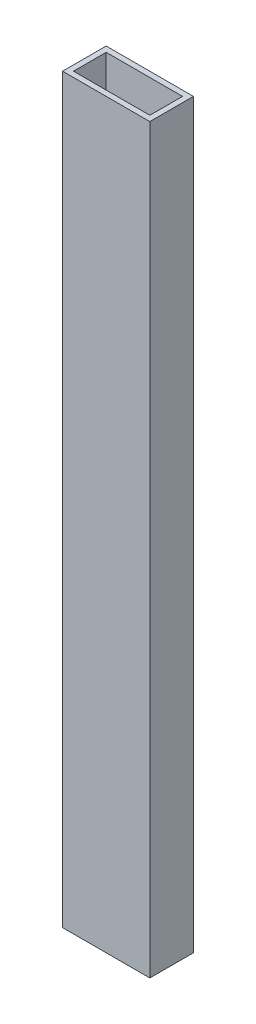
ISO-10303-21;
HEADER;
FILE_DESCRIPTION(('STEP AP214'),'2;1');
FILE_NAME('part.step','',(''),(''),'','','');
FILE_SCHEMA(('AUTOMOTIVE_DESIGN { 1 0 10303 214 1 1 1 1 }'));
ENDSEC;
DATA;
#1=APPLICATION_CONTEXT('core data for automotive mechanical design processes');
#2=APPLICATION_PROTOCOL_DEFINITION('international standard','automotive_design',2000,#1);
#3=PRODUCT_CONTEXT('',#1,'mechanical');
#4=PRODUCT('Part','Part','',(#3));
#5=PRODUCT_RELATED_PRODUCT_CATEGORY('part','',(#4));
#6=PRODUCT_DEFINITION_FORMATION('','',#4);
#7=PRODUCT_DEFINITION_CONTEXT('part definition',#1,'design');
#8=PRODUCT_DEFINITION('design','',#6,#7);
#9=PRODUCT_DEFINITION_SHAPE('','',#8);
#10=(LENGTH_UNIT() NAMED_UNIT(*) SI_UNIT(.MILLI.,.METRE.));
#11=(NAMED_UNIT(*) PLANE_ANGLE_UNIT() SI_UNIT($,.RADIAN.));
#12=(NAMED_UNIT(*) SI_UNIT($,.STERADIAN.) SOLID_ANGLE_UNIT());
#13=UNCERTAINTY_MEASURE_WITH_UNIT(LENGTH_MEASURE(1.E-05),#10,'distance_accuracy_value','');
#14=(GEOMETRIC_REPRESENTATION_CONTEXT(3) GLOBAL_UNCERTAINTY_ASSIGNED_CONTEXT((#13)) GLOBAL_UNIT_ASSIGNED_CONTEXT((#10,
#11,#12)) REPRESENTATION_CONTEXT('',''));
#15=CARTESIAN_POINT('',(0.,0.,0.));
#16=DIRECTION('',(0.,0.,1.));
#17=DIRECTION('',(1.,0.,0.));
#18=AXIS2_PLACEMENT_3D('',#15,#16,#17);
#19=CARTESIAN_POINT('',(0.,431.8,0.));
#20=DIRECTION('',(0.,-1.,0.));
#21=DIRECTION('',(0.,0.,-1.));
#22=AXIS2_PLACEMENT_3D('',#19,#20,#21);
#23=PLANE('',#22);
#24=DIRECTION('',(0.,0.,1.));
#25=VECTOR('',#24,1.);
#26=CARTESIAN_POINT('',(0.,431.8,0.));
#27=LINE('',#26,#25);
#28=CARTESIAN_POINT('',(0.,431.8,-25.4));
#29=VERTEX_POINT('',#28);
#30=CARTESIAN_POINT('',(0.,431.8,0.));
#31=VERTEX_POINT('',#30);
#32=EDGE_CURVE('E134',#29,#31,#27,.T.);
#33=ORIENTED_EDGE('',*,*,#32,.T.);
#34=DIRECTION('',(1.,0.,0.));
#35=VECTOR('',#34,1.);
#36=CARTESIAN_POINT('',(0.,431.8,0.));
#37=LINE('',#36,#35);
#38=CARTESIAN_POINT('',(50.8,431.8,0.));
#39=VERTEX_POINT('',#38);
#40=EDGE_CURVE('E137',#31,#39,#37,.T.);
#41=ORIENTED_EDGE('',*,*,#40,.T.);
#42=DIRECTION('',(0.,0.,-1.));
#43=VECTOR('',#42,1.);
#44=CARTESIAN_POINT('',(50.8,431.8,0.));
#45=LINE('',#44,#43);
#46=CARTESIAN_POINT('',(50.8,431.8,-25.4));
#47=VERTEX_POINT('',#46);
#48=EDGE_CURVE('E140',#39,#47,#45,.T.);
#49=ORIENTED_EDGE('',*,*,#48,.T.);
#50=DIRECTION('',(-1.,0.,0.));
#51=VECTOR('',#50,1.);
#52=CARTESIAN_POINT('',(0.,431.8,-25.4));
#53=LINE('',#52,#51);
#54=EDGE_CURVE('E142',#47,#29,#53,.T.);
#55=ORIENTED_EDGE('',*,*,#54,.T.);
#56=EDGE_LOOP('',(#33,#41,#49,#55));
#57=FACE_BOUND('',#56,.T.);
#58=DIRECTION('',(0.,0.,1.));
#59=VECTOR('',#58,1.);
#60=CARTESIAN_POINT('',(3.175,431.8,-22.225));
#61=LINE('',#60,#59);
#62=CARTESIAN_POINT('',(3.175,431.8,-22.225));
#63=VERTEX_POINT('',#62);
#64=CARTESIAN_POINT('',(3.175,431.8,-3.175));
#65=VERTEX_POINT('',#64);
#66=EDGE_CURVE('E98',#63,#65,#61,.T.);
#67=ORIENTED_EDGE('',*,*,#66,.F.);
#68=DIRECTION('',(-1.,0.,0.));
#69=VECTOR('',#68,1.);
#70=CARTESIAN_POINT('',(3.175,431.8,-22.225));
#71=LINE('',#70,#69);
#72=CARTESIAN_POINT('',(47.625,431.8,-22.225));
#73=VERTEX_POINT('',#72);
#74=EDGE_CURVE('E120',#73,#63,#71,.T.);
#75=ORIENTED_EDGE('',*,*,#74,.F.);
#76=DIRECTION('',(0.,0.,-1.));
#77=VECTOR('',#76,1.);
#78=CARTESIAN_POINT('',(47.625,431.8,-22.225));
#79=LINE('',#78,#77);
#80=CARTESIAN_POINT('',(47.625,431.8,-3.175));
#81=VERTEX_POINT('',#80);
#82=EDGE_CURVE('E118',#81,#73,#79,.T.);
#83=ORIENTED_EDGE('',*,*,#82,.F.);
#84=DIRECTION('',(1.,0.,0.));
#85=VECTOR('',#84,1.);
#86=CARTESIAN_POINT('',(3.175,431.8,-3.175));
#87=LINE('',#86,#85);
#88=EDGE_CURVE('E106',#65,#81,#87,.T.);
#89=ORIENTED_EDGE('',*,*,#88,.F.);
#90=EDGE_LOOP('',(#67,#75,#83,#89));
#91=FACE_BOUND('',#90,.T.);
#92=ADVANCED_FACE('F33',(#57,#91),#23,.F.);
#93=CARTESIAN_POINT('',(0.,0.,0.));
#94=DIRECTION('',(0.,-1.,0.));
#95=DIRECTION('',(0.,0.,-1.));
#96=AXIS2_PLACEMENT_3D('',#93,#94,#95);
#97=PLANE('',#96);
#98=DIRECTION('',(0.,0.,1.));
#99=VECTOR('',#98,1.);
#100=CARTESIAN_POINT('',(0.,0.,0.));
#101=LINE('',#100,#99);
#102=CARTESIAN_POINT('',(0.,0.,-25.4));
#103=VERTEX_POINT('',#102);
#104=CARTESIAN_POINT('',(0.,0.,0.));
#105=VERTEX_POINT('',#104);
#106=EDGE_CURVE('E114',#103,#105,#101,.T.);
#107=ORIENTED_EDGE('',*,*,#106,.F.);
#108=DIRECTION('',(-1.,0.,0.));
#109=VECTOR('',#108,1.);
#110=CARTESIAN_POINT('',(0.,0.,-25.4));
#111=LINE('',#110,#109);
#112=CARTESIAN_POINT('',(50.8,0.,-25.4));
#113=VERTEX_POINT('',#112);
#114=EDGE_CURVE('E138',#113,#103,#111,.T.);
#115=ORIENTED_EDGE('',*,*,#114,.F.);
#116=DIRECTION('',(0.,0.,-1.));
#117=VECTOR('',#116,1.);
#118=CARTESIAN_POINT('',(50.8,0.,0.));
#119=LINE('',#118,#117);
#120=CARTESIAN_POINT('',(50.8,0.,0.));
#121=VERTEX_POINT('',#120);
#122=EDGE_CURVE('E149',#121,#113,#119,.T.);
#123=ORIENTED_EDGE('',*,*,#122,.F.);
#124=DIRECTION('',(1.,0.,0.));
#125=VECTOR('',#124,1.);
#126=CARTESIAN_POINT('',(0.,0.,0.));
#127=LINE('',#126,#125);
#128=EDGE_CURVE('E147',#105,#121,#127,.T.);
#129=ORIENTED_EDGE('',*,*,#128,.F.);
#130=EDGE_LOOP('',(#107,#115,#123,#129));
#131=FACE_BOUND('',#130,.T.);
#132=DIRECTION('',(-1.,0.,0.));
#133=VECTOR('',#132,1.);
#134=CARTESIAN_POINT('',(3.175,0.,-22.225));
#135=LINE('',#134,#133);
#136=CARTESIAN_POINT('',(47.625,0.,-22.225));
#137=VERTEX_POINT('',#136);
#138=CARTESIAN_POINT('',(3.175,0.,-22.225));
#139=VERTEX_POINT('',#138);
#140=EDGE_CURVE('E107',#137,#139,#135,.T.);
#141=ORIENTED_EDGE('',*,*,#140,.T.);
#142=DIRECTION('',(0.,0.,1.));
#143=VECTOR('',#142,1.);
#144=CARTESIAN_POINT('',(3.175,0.,-22.225));
#145=LINE('',#144,#143);
#146=CARTESIAN_POINT('',(3.175,0.,-3.175));
#147=VERTEX_POINT('',#146);
#148=EDGE_CURVE('E56',#139,#147,#145,.T.);
#149=ORIENTED_EDGE('',*,*,#148,.T.);
#150=DIRECTION('',(1.,0.,0.));
#151=VECTOR('',#150,1.);
#152=CARTESIAN_POINT('',(3.175,0.,-3.175));
#153=LINE('',#152,#151);
#154=CARTESIAN_POINT('',(47.625,0.,-3.175));
#155=VERTEX_POINT('',#154);
#156=EDGE_CURVE('E113',#147,#155,#153,.T.);
#157=ORIENTED_EDGE('',*,*,#156,.T.);
#158=DIRECTION('',(0.,0.,-1.));
#159=VECTOR('',#158,1.);
#160=CARTESIAN_POINT('',(47.625,0.,-22.225));
#161=LINE('',#160,#159);
#162=EDGE_CURVE('E126',#155,#137,#161,.T.);
#163=ORIENTED_EDGE('',*,*,#162,.T.);
#164=EDGE_LOOP('',(#141,#149,#157,#163));
#165=FACE_BOUND('',#164,.T.);
#166=ADVANCED_FACE('F167',(#131,#165),#97,.T.);
#167=CARTESIAN_POINT('',(0.,431.8,0.));
#168=DIRECTION('',(1.,0.,0.));
#169=DIRECTION('',(0.,0.,-1.));
#170=AXIS2_PLACEMENT_3D('',#167,#168,#169);
#171=PLANE('',#170);
#172=ORIENTED_EDGE('',*,*,#106,.T.);
#173=DIRECTION('',(0.,-1.,0.));
#174=VECTOR('',#173,1.);
#175=CARTESIAN_POINT('',(0.,431.8,0.));
#176=LINE('',#175,#174);
#177=EDGE_CURVE('E11',#31,#105,#176,.T.);
#178=ORIENTED_EDGE('',*,*,#177,.F.);
#179=ORIENTED_EDGE('',*,*,#32,.F.);
#180=DIRECTION('',(0.,-1.,0.));
#181=VECTOR('',#180,1.);
#182=CARTESIAN_POINT('',(0.,431.8,-25.4));
#183=LINE('',#182,#181);
#184=EDGE_CURVE('E144',#29,#103,#183,.T.);
#185=ORIENTED_EDGE('',*,*,#184,.T.);
#186=EDGE_LOOP('',(#172,#178,#179,#185));
#187=FACE_BOUND('',#186,.T.);
#188=ADVANCED_FACE('F35',(#187),#171,.F.);
#189=CARTESIAN_POINT('',(0.,431.8,0.));
#190=DIRECTION('',(0.,0.,-1.));
#191=DIRECTION('',(-1.,0.,0.));
#192=AXIS2_PLACEMENT_3D('',#189,#190,#191);
#193=PLANE('',#192);
#194=ORIENTED_EDGE('',*,*,#128,.T.);
#195=DIRECTION('',(0.,-1.,0.));
#196=VECTOR('',#195,1.);
#197=CARTESIAN_POINT('',(50.8,431.8,0.));
#198=LINE('',#197,#196);
#199=EDGE_CURVE('E41',#39,#121,#198,.T.);
#200=ORIENTED_EDGE('',*,*,#199,.F.);
#201=ORIENTED_EDGE('',*,*,#40,.F.);
#202=ORIENTED_EDGE('',*,*,#177,.T.);
#203=EDGE_LOOP('',(#194,#200,#201,#202));
#204=FACE_BOUND('',#203,.T.);
#205=ADVANCED_FACE('F177',(#204),#193,.F.);
#206=CARTESIAN_POINT('',(50.8,431.8,0.));
#207=DIRECTION('',(-1.,0.,0.));
#208=DIRECTION('',(0.,0.,1.));
#209=AXIS2_PLACEMENT_3D('',#206,#207,#208);
#210=PLANE('',#209);
#211=ORIENTED_EDGE('',*,*,#122,.T.);
#212=DIRECTION('',(0.,-1.,0.));
#213=VECTOR('',#212,1.);
#214=CARTESIAN_POINT('',(50.8,431.8,-25.4));
#215=LINE('',#214,#213);
#216=EDGE_CURVE('E154',#47,#113,#215,.T.);
#217=ORIENTED_EDGE('',*,*,#216,.F.);
#218=ORIENTED_EDGE('',*,*,#48,.F.);
#219=ORIENTED_EDGE('',*,*,#199,.T.);
#220=EDGE_LOOP('',(#211,#217,#218,#219));
#221=FACE_BOUND('',#220,.T.);
#222=ADVANCED_FACE('F161',(#221),#210,.F.);
#223=CARTESIAN_POINT('',(0.,431.8,-25.4));
#224=DIRECTION('',(0.,0.,1.));
#225=DIRECTION('',(1.,0.,0.));
#226=AXIS2_PLACEMENT_3D('',#223,#224,#225);
#227=PLANE('',#226);
#228=ORIENTED_EDGE('',*,*,#114,.T.);
#229=ORIENTED_EDGE('',*,*,#184,.F.);
#230=ORIENTED_EDGE('',*,*,#54,.F.);
#231=ORIENTED_EDGE('',*,*,#216,.T.);
#232=EDGE_LOOP('',(#228,#229,#230,#231));
#233=FACE_BOUND('',#232,.T.);
#234=ADVANCED_FACE('F171',(#233),#227,.F.);
#235=CARTESIAN_POINT('',(3.175,431.8,-22.225));
#236=DIRECTION('',(1.,0.,0.));
#237=DIRECTION('',(0.,0.,-1.));
#238=AXIS2_PLACEMENT_3D('',#235,#236,#237);
#239=PLANE('',#238);
#240=ORIENTED_EDGE('',*,*,#148,.F.);
#241=DIRECTION('',(0.,-1.,0.));
#242=VECTOR('',#241,1.);
#243=CARTESIAN_POINT('',(3.175,431.8,-22.225));
#244=LINE('',#243,#242);
#245=EDGE_CURVE('E102',#63,#139,#244,.T.);
#246=ORIENTED_EDGE('',*,*,#245,.F.);
#247=ORIENTED_EDGE('',*,*,#66,.T.);
#248=DIRECTION('',(0.,-1.,0.));
#249=VECTOR('',#248,1.);
#250=CARTESIAN_POINT('',(3.175,431.8,-3.175));
#251=LINE('',#250,#249);
#252=EDGE_CURVE('E101',#65,#147,#251,.T.);
#253=ORIENTED_EDGE('',*,*,#252,.T.);
#254=EDGE_LOOP('',(#240,#246,#247,#253));
#255=FACE_BOUND('',#254,.T.);
#256=ADVANCED_FACE('F100',(#255),#239,.T.);
#257=CARTESIAN_POINT('',(3.175,431.8,-3.175));
#258=DIRECTION('',(0.,0.,-1.));
#259=DIRECTION('',(-1.,0.,0.));
#260=AXIS2_PLACEMENT_3D('',#257,#258,#259);
#261=PLANE('',#260);
#262=ORIENTED_EDGE('',*,*,#156,.F.);
#263=ORIENTED_EDGE('',*,*,#252,.F.);
#264=ORIENTED_EDGE('',*,*,#88,.T.);
#265=DIRECTION('',(0.,-1.,0.));
#266=VECTOR('',#265,1.);
#267=CARTESIAN_POINT('',(47.625,431.8,-3.175));
#268=LINE('',#267,#266);
#269=EDGE_CURVE('E115',#81,#155,#268,.T.);
#270=ORIENTED_EDGE('',*,*,#269,.T.);
#271=EDGE_LOOP('',(#262,#263,#264,#270));
#272=FACE_BOUND('',#271,.T.);
#273=ADVANCED_FACE('F110',(#272),#261,.T.);
#274=CARTESIAN_POINT('',(47.625,431.8,-22.225));
#275=DIRECTION('',(-1.,0.,0.));
#276=DIRECTION('',(0.,0.,1.));
#277=AXIS2_PLACEMENT_3D('',#274,#275,#276);
#278=PLANE('',#277);
#279=ORIENTED_EDGE('',*,*,#162,.F.);
#280=ORIENTED_EDGE('',*,*,#269,.F.);
#281=ORIENTED_EDGE('',*,*,#82,.T.);
#282=DIRECTION('',(0.,-1.,0.));
#283=VECTOR('',#282,1.);
#284=CARTESIAN_POINT('',(47.625,431.8,-22.225));
#285=LINE('',#284,#283);
#286=EDGE_CURVE('E48',#73,#137,#285,.T.);
#287=ORIENTED_EDGE('',*,*,#286,.T.);
#288=EDGE_LOOP('',(#279,#280,#281,#287));
#289=FACE_BOUND('',#288,.T.);
#290=ADVANCED_FACE('F200',(#289),#278,.T.);
#291=CARTESIAN_POINT('',(3.175,431.8,-22.225));
#292=DIRECTION('',(0.,0.,1.));
#293=DIRECTION('',(1.,0.,0.));
#294=AXIS2_PLACEMENT_3D('',#291,#292,#293);
#295=PLANE('',#294);
#296=ORIENTED_EDGE('',*,*,#140,.F.);
#297=ORIENTED_EDGE('',*,*,#286,.F.);
#298=ORIENTED_EDGE('',*,*,#74,.T.);
#299=ORIENTED_EDGE('',*,*,#245,.T.);
#300=EDGE_LOOP('',(#296,#297,#298,#299));
#301=FACE_BOUND('',#300,.T.);
#302=ADVANCED_FACE('F204',(#301),#295,.T.);
#303=CLOSED_SHELL('',(#92,#166,#188,#205,#222,#234,#256,#273,#290,#302));
#304=MANIFOLD_SOLID_BREP('B2',#303);
#305=ADVANCED_BREP_SHAPE_REPRESENTATION('',(#18,#304),#14);
#306=SHAPE_DEFINITION_REPRESENTATION(#9,#305);
ENDSEC;
END-ISO-10303-21;
